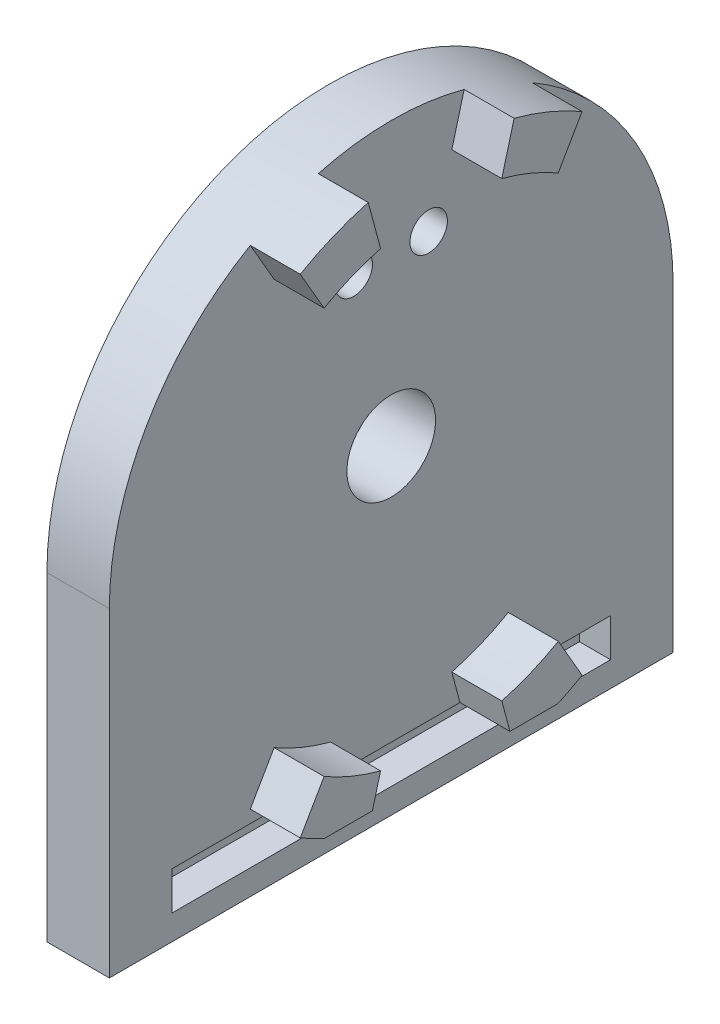
ISO-10303-21;
HEADER;
FILE_DESCRIPTION(('STEP AP214'),'2;1');
FILE_NAME('part.step','',(''),(''),'','','');
FILE_SCHEMA(('AUTOMOTIVE_DESIGN { 1 0 10303 214 1 1 1 1 }'));
ENDSEC;
DATA;
#1=APPLICATION_CONTEXT('core data for automotive mechanical design processes');
#2=APPLICATION_PROTOCOL_DEFINITION('international standard','automotive_design',2000,#1);
#3=PRODUCT_CONTEXT('',#1,'mechanical');
#4=PRODUCT('Part','Part','',(#3));
#5=PRODUCT_RELATED_PRODUCT_CATEGORY('part','',(#4));
#6=PRODUCT_DEFINITION_FORMATION('','',#4);
#7=PRODUCT_DEFINITION_CONTEXT('part definition',#1,'design');
#8=PRODUCT_DEFINITION('design','',#6,#7);
#9=PRODUCT_DEFINITION_SHAPE('','',#8);
#10=(LENGTH_UNIT() NAMED_UNIT(*) SI_UNIT(.MILLI.,.METRE.));
#11=(NAMED_UNIT(*) PLANE_ANGLE_UNIT() SI_UNIT($,.RADIAN.));
#12=(NAMED_UNIT(*) SI_UNIT($,.STERADIAN.) SOLID_ANGLE_UNIT());
#13=UNCERTAINTY_MEASURE_WITH_UNIT(LENGTH_MEASURE(1.E-05),#10,'distance_accuracy_value','');
#14=(GEOMETRIC_REPRESENTATION_CONTEXT(3) GLOBAL_UNCERTAINTY_ASSIGNED_CONTEXT((#13)) GLOBAL_UNIT_ASSIGNED_CONTEXT((#10,
#11,#12)) REPRESENTATION_CONTEXT('',''));
#15=CARTESIAN_POINT('',(0.,0.,0.));
#16=DIRECTION('',(0.,0.,1.));
#17=DIRECTION('',(1.,0.,0.));
#18=AXIS2_PLACEMENT_3D('',#15,#16,#17);
#19=CARTESIAN_POINT('',(5.,0.,0.));
#20=DIRECTION('',(1.,0.,0.));
#21=DIRECTION('',(0.,0.,-1.));
#22=AXIS2_PLACEMENT_3D('',#19,#20,#21);
#23=PLANE('',#22);
#24=CARTESIAN_POINT('',(5.,0.,0.));
#25=DIRECTION('',(1.,0.,0.));
#26=DIRECTION('',(0.,0.,-1.));
#27=AXIS2_PLACEMENT_3D('',#24,#25,#26);
#28=CIRCLE('',#27,3.55);
#29=CARTESIAN_POINT('',(5.,0.,-3.55));
#30=VERTEX_POINT('',#29);
#31=EDGE_CURVE('E394',#30,#30,#28,.T.);
#32=ORIENTED_EDGE('',*,*,#31,.F.);
#33=EDGE_LOOP('',(#32));
#34=FACE_BOUND('',#33,.T.);
#35=CARTESIAN_POINT('',(5.,13.3711548870498,-3.00000000000006));
#36=DIRECTION('',(1.,0.,0.));
#37=DIRECTION('',(0.,0.,-1.));
#38=AXIS2_PLACEMENT_3D('',#35,#36,#37);
#39=CIRCLE('',#38,1.5);
#40=CARTESIAN_POINT('',(5.,13.3711548870498,-4.50000000000006));
#41=VERTEX_POINT('',#40);
#42=EDGE_CURVE('E391',#41,#41,#39,.T.);
#43=ORIENTED_EDGE('',*,*,#42,.F.);
#44=EDGE_LOOP('',(#43));
#45=FACE_BOUND('',#44,.T.);
#46=CARTESIAN_POINT('',(5.,13.3711548870498,2.99999999999995));
#47=DIRECTION('',(1.,0.,0.));
#48=DIRECTION('',(0.,0.,-1.));
#49=AXIS2_PLACEMENT_3D('',#46,#47,#48);
#50=CIRCLE('',#49,1.5);
#51=CARTESIAN_POINT('',(5.,13.3711548870498,1.49999999999994));
#52=VERTEX_POINT('',#51);
#53=EDGE_CURVE('E388',#52,#52,#50,.T.);
#54=ORIENTED_EDGE('',*,*,#53,.F.);
#55=EDGE_LOOP('',(#54));
#56=FACE_BOUND('',#55,.T.);
#57=CARTESIAN_POINT('',(5.,0.,0.));
#58=DIRECTION('',(1.,0.,0.));
#59=DIRECTION('',(0.,0.,-1.));
#60=AXIS2_PLACEMENT_3D('',#57,#58,#59);
#61=CIRCLE('',#60,22.5679605264164);
#62=CARTESIAN_POINT('',(5.,0.,-22.5679605264164));
#63=VERTEX_POINT('',#62);
#64=CARTESIAN_POINT('',(5.,19.544427127481,-11.2839802632083));
#65=VERTEX_POINT('',#64);
#66=EDGE_CURVE('E11',#63,#65,#61,.T.);
#67=ORIENTED_EDGE('',*,*,#66,.T.);
#68=DIRECTION('',(0.,0.866025403784436,-0.500000000000004));
#69=VECTOR('',#68,1.);
#70=CARTESIAN_POINT('',(5.,0.,0.));
#71=LINE('',#70,#69);
#72=CARTESIAN_POINT('',(5.,16.2379763209582,-9.37500000000008));
#73=VERTEX_POINT('',#72);
#74=EDGE_CURVE('E299',#73,#65,#71,.T.);
#75=ORIENTED_EDGE('',*,*,#74,.F.);
#76=CARTESIAN_POINT('',(5.,0.,0.));
#77=DIRECTION('',(1.,0.,0.));
#78=DIRECTION('',(0.,0.,-1.));
#79=AXIS2_PLACEMENT_3D('',#76,#77,#78);
#80=CIRCLE('',#79,18.75);
#81=CARTESIAN_POINT('',(5.,18.11110924292,-4.85285709567234));
#82=VERTEX_POINT('',#81);
#83=EDGE_CURVE('E285',#73,#82,#80,.T.);
#84=ORIENTED_EDGE('',*,*,#83,.T.);
#85=DIRECTION('',(0.,0.965925826289067,-0.258819045102525));
#86=VECTOR('',#85,1.);
#87=CARTESIAN_POINT('',(5.,0.,0.));
#88=LINE('',#87,#86);
#89=CARTESIAN_POINT('',(5.,21.7989759191378,-5.84101799335856));
#90=VERTEX_POINT('',#89);
#91=EDGE_CURVE('E290',#82,#90,#88,.T.);
#92=ORIENTED_EDGE('',*,*,#91,.T.);
#93=CARTESIAN_POINT('',(5.,21.7989759191378,5.84101799335841));
#94=VERTEX_POINT('',#93);
#95=EDGE_CURVE('E43',#90,#94,#61,.T.);
#96=ORIENTED_EDGE('',*,*,#95,.T.);
#97=DIRECTION('',(0.,0.965925826289069,0.258819045102518));
#98=VECTOR('',#97,1.);
#99=CARTESIAN_POINT('',(5.,0.,0.));
#100=LINE('',#99,#98);
#101=CARTESIAN_POINT('',(5.,18.1111092429201,4.85285709567222));
#102=VERTEX_POINT('',#101);
#103=EDGE_CURVE('E329',#102,#94,#100,.T.);
#104=ORIENTED_EDGE('',*,*,#103,.F.);
#105=CARTESIAN_POINT('',(5.,0.,0.));
#106=DIRECTION('',(1.,0.,0.));
#107=DIRECTION('',(0.,0.,-1.));
#108=AXIS2_PLACEMENT_3D('',#105,#106,#107);
#109=CIRCLE('',#108,18.75);
#110=CARTESIAN_POINT('',(5.,16.2379763209582,9.37499999999997));
#111=VERTEX_POINT('',#110);
#112=EDGE_CURVE('E315',#102,#111,#109,.T.);
#113=ORIENTED_EDGE('',*,*,#112,.T.);
#114=DIRECTION('',(0.,0.86602540378444,0.499999999999998));
#115=VECTOR('',#114,1.);
#116=CARTESIAN_POINT('',(5.,0.,0.));
#117=LINE('',#116,#115);
#118=CARTESIAN_POINT('',(5.,19.544427127481,11.2839802632081));
#119=VERTEX_POINT('',#118);
#120=EDGE_CURVE('E320',#111,#119,#117,.T.);
#121=ORIENTED_EDGE('',*,*,#120,.T.);
#122=CARTESIAN_POINT('',(5.,0.,22.5679605264164));
#123=VERTEX_POINT('',#122);
#124=EDGE_CURVE('E44',#119,#123,#61,.T.);
#125=ORIENTED_EDGE('',*,*,#124,.T.);
#126=DIRECTION('',(0.,-1.,0.));
#127=VECTOR('',#126,1.);
#128=CARTESIAN_POINT('',(5.,0.,22.5679605264164));
#129=LINE('',#128,#127);
#130=CARTESIAN_POINT('',(5.,-25.6160132593581,22.5679605264164));
#131=VERTEX_POINT('',#130);
#132=EDGE_CURVE('E397',#123,#131,#129,.T.);
#133=ORIENTED_EDGE('',*,*,#132,.T.);
#134=DIRECTION('',(0.,0.,-1.));
#135=VECTOR('',#134,1.);
#136=CARTESIAN_POINT('',(5.,-25.6160132593581,22.5679605264164));
#137=LINE('',#136,#135);
#138=CARTESIAN_POINT('',(5.,-25.6160132593581,-22.5679605264164));
#139=VERTEX_POINT('',#138);
#140=EDGE_CURVE('E410',#131,#139,#137,.T.);
#141=ORIENTED_EDGE('',*,*,#140,.T.);
#142=DIRECTION('',(0.,1.,0.));
#143=VECTOR('',#142,1.);
#144=CARTESIAN_POINT('',(5.,-25.6160132593581,-22.5679605264164));
#145=LINE('',#144,#143);
#146=EDGE_CURVE('E402',#139,#63,#145,.T.);
#147=ORIENTED_EDGE('',*,*,#146,.T.);
#148=EDGE_LOOP('',(#67,#75,#84,#92,#96,#104,#113,#121,#125,#133,#141,#147));
#149=FACE_BOUND('',#148,.T.);
#150=DIRECTION('',(0.,0.,1.));
#151=VECTOR('',#150,1.);
#152=CARTESIAN_POINT('',(5.,-20.55,17.5679605264164));
#153=LINE('',#152,#151);
#154=CARTESIAN_POINT('',(5.,-20.55,-5.50635590445966));
#155=VERTEX_POINT('',#154);
#156=CARTESIAN_POINT('',(5.,-20.55,5.50635590445952));
#157=VERTEX_POINT('',#156);
#158=EDGE_CURVE('E369',#155,#157,#153,.T.);
#159=ORIENTED_EDGE('',*,*,#158,.F.);
#160=DIRECTION('',(0.,-0.965925826289067,-0.258819045102525));
#161=VECTOR('',#160,1.);
#162=CARTESIAN_POINT('',(5.,0.,0.));
#163=LINE('',#162,#161);
#164=CARTESIAN_POINT('',(5.,-18.11110924292,-4.85285709567234));
#165=VERTEX_POINT('',#164);
#166=EDGE_CURVE('E235',#165,#155,#163,.T.);
#167=ORIENTED_EDGE('',*,*,#166,.F.);
#168=CARTESIAN_POINT('',(5.,0.,0.));
#169=DIRECTION('',(1.,0.,0.));
#170=DIRECTION('',(0.,0.,-1.));
#171=AXIS2_PLACEMENT_3D('',#168,#169,#170);
#172=CIRCLE('',#171,18.75);
#173=CARTESIAN_POINT('',(5.,-16.2379763209582,-9.37500000000008));
#174=VERTEX_POINT('',#173);
#175=EDGE_CURVE('E244',#174,#165,#172,.F.);
#176=ORIENTED_EDGE('',*,*,#175,.F.);
#177=DIRECTION('',(0.,-0.866025403784436,-0.500000000000004));
#178=VECTOR('',#177,1.);
#179=CARTESIAN_POINT('',(5.,0.,0.));
#180=LINE('',#179,#178);
#181=CARTESIAN_POINT('',(5.,-19.544427127481,-11.2839802632083));
#182=VERTEX_POINT('',#181);
#183=EDGE_CURVE('E216',#174,#182,#180,.T.);
#184=ORIENTED_EDGE('',*,*,#183,.T.);
#185=CARTESIAN_POINT('',(5.,0.,0.));
#186=DIRECTION('',(1.,0.,0.));
#187=DIRECTION('',(0.,0.,-1.));
#188=AXIS2_PLACEMENT_3D('',#185,#186,#187);
#189=CIRCLE('',#188,22.5679605264164);
#190=CARTESIAN_POINT('',(5.,-20.55,-9.32793344325995));
#191=VERTEX_POINT('',#190);
#192=EDGE_CURVE('E232',#182,#191,#189,.F.);
#193=ORIENTED_EDGE('',*,*,#192,.T.);
#194=CARTESIAN_POINT('',(5.,-20.55,-17.5679605264164));
#195=VERTEX_POINT('',#194);
#196=EDGE_CURVE('E349',#195,#191,#153,.T.);
#197=ORIENTED_EDGE('',*,*,#196,.F.);
#198=DIRECTION('',(0.,1.,0.));
#199=VECTOR('',#198,1.);
#200=CARTESIAN_POINT('',(5.,-20.55,-17.5679605264164));
#201=LINE('',#200,#199);
#202=CARTESIAN_POINT('',(5.,-23.6160132593581,-17.5679605264164));
#203=VERTEX_POINT('',#202);
#204=EDGE_CURVE('E363',#203,#195,#201,.T.);
#205=ORIENTED_EDGE('',*,*,#204,.F.);
#206=DIRECTION('',(0.,0.,-1.));
#207=VECTOR('',#206,1.);
#208=CARTESIAN_POINT('',(5.,-23.6160132593581,17.5679605264164));
#209=LINE('',#208,#207);
#210=CARTESIAN_POINT('',(5.,-23.6160132593581,17.5679605264164));
#211=VERTEX_POINT('',#210);
#212=EDGE_CURVE('E360',#211,#203,#209,.T.);
#213=ORIENTED_EDGE('',*,*,#212,.F.);
#214=DIRECTION('',(0.,-1.,0.));
#215=VECTOR('',#214,1.);
#216=CARTESIAN_POINT('',(5.,-20.55,17.5679605264164));
#217=LINE('',#216,#215);
#218=CARTESIAN_POINT('',(5.,-20.55,17.5679605264164));
#219=VERTEX_POINT('',#218);
#220=EDGE_CURVE('E344',#219,#211,#217,.T.);
#221=ORIENTED_EDGE('',*,*,#220,.F.);
#222=CARTESIAN_POINT('',(5.,-20.55,9.32793344325995));
#223=VERTEX_POINT('',#222);
#224=EDGE_CURVE('E366',#223,#219,#153,.T.);
#225=ORIENTED_EDGE('',*,*,#224,.F.);
#226=CARTESIAN_POINT('',(5.,0.,0.));
#227=DIRECTION('',(1.,0.,0.));
#228=DIRECTION('',(0.,0.,-1.));
#229=AXIS2_PLACEMENT_3D('',#226,#227,#228);
#230=CIRCLE('',#229,22.5679605264164);
#231=CARTESIAN_POINT('',(5.,-19.544427127481,11.2839802632081));
#232=VERTEX_POINT('',#231);
#233=EDGE_CURVE('E59',#223,#232,#230,.F.);
#234=ORIENTED_EDGE('',*,*,#233,.T.);
#235=DIRECTION('',(0.,-0.86602540378444,0.499999999999998));
#236=VECTOR('',#235,1.);
#237=CARTESIAN_POINT('',(5.,0.,0.));
#238=LINE('',#237,#236);
#239=CARTESIAN_POINT('',(5.,-16.2379763209582,9.37499999999996));
#240=VERTEX_POINT('',#239);
#241=EDGE_CURVE('E256',#240,#232,#238,.T.);
#242=ORIENTED_EDGE('',*,*,#241,.F.);
#243=CARTESIAN_POINT('',(5.,0.,0.));
#244=DIRECTION('',(1.,0.,0.));
#245=DIRECTION('',(0.,0.,-1.));
#246=AXIS2_PLACEMENT_3D('',#243,#244,#245);
#247=CIRCLE('',#246,18.75);
#248=CARTESIAN_POINT('',(5.,-18.11110924292,4.85285709567222));
#249=VERTEX_POINT('',#248);
#250=EDGE_CURVE('E270',#249,#240,#247,.F.);
#251=ORIENTED_EDGE('',*,*,#250,.F.);
#252=DIRECTION('',(0.,-0.965925826289069,0.258819045102518));
#253=VECTOR('',#252,1.);
#254=CARTESIAN_POINT('',(5.,0.,0.));
#255=LINE('',#254,#253);
#256=EDGE_CURVE('E267',#249,#157,#255,.T.);
#257=ORIENTED_EDGE('',*,*,#256,.T.);
#258=EDGE_LOOP('',(#159,#167,#176,#184,#193,#197,#205,#213,#221,#225,#234,#242,#251,#257));
#259=FACE_BOUND('',#258,.T.);
#260=ADVANCED_FACE('F34',(#34,#45,#56,#149,#259),#23,.T.);
#261=CARTESIAN_POINT('',(5.,0.,0.));
#262=DIRECTION('',(-1.,0.,0.));
#263=DIRECTION('',(0.,0.,1.));
#264=AXIS2_PLACEMENT_3D('',#261,#262,#263);
#265=CYLINDRICAL_SURFACE('',#264,22.5679605264164);
#266=ORIENTED_EDGE('',*,*,#66,.F.);
#267=DIRECTION('',(1.,0.,0.));
#268=VECTOR('',#267,1.);
#269=CARTESIAN_POINT('',(0.,0.,-22.5679605264164));
#270=LINE('',#269,#268);
#271=CARTESIAN_POINT('',(0.,0.,-22.5679605264164));
#272=VERTEX_POINT('',#271);
#273=EDGE_CURVE('E414',#272,#63,#270,.T.);
#274=ORIENTED_EDGE('',*,*,#273,.F.);
#275=CARTESIAN_POINT('',(0.,0.,0.));
#276=DIRECTION('',(1.,0.,0.));
#277=DIRECTION('',(0.,0.,-1.));
#278=AXIS2_PLACEMENT_3D('',#275,#276,#277);
#279=CIRCLE('',#278,22.5679605264164);
#280=CARTESIAN_POINT('',(0.,0.,22.5679605264164));
#281=VERTEX_POINT('',#280);
#282=EDGE_CURVE('E38',#272,#281,#279,.T.);
#283=ORIENTED_EDGE('',*,*,#282,.T.);
#284=DIRECTION('',(1.,0.,0.));
#285=VECTOR('',#284,1.);
#286=CARTESIAN_POINT('',(0.,0.,22.5679605264164));
#287=LINE('',#286,#285);
#288=EDGE_CURVE('E407',#281,#123,#287,.T.);
#289=ORIENTED_EDGE('',*,*,#288,.T.);
#290=ORIENTED_EDGE('',*,*,#124,.F.);
#291=DIRECTION('',(-1.,0.,0.));
#292=VECTOR('',#291,1.);
#293=CARTESIAN_POINT('',(9.,19.544427127481,11.2839802632081));
#294=LINE('',#293,#292);
#295=CARTESIAN_POINT('',(9.,19.544427127481,11.2839802632081));
#296=VERTEX_POINT('',#295);
#297=EDGE_CURVE('E335',#296,#119,#294,.T.);
#298=ORIENTED_EDGE('',*,*,#297,.F.);
#299=CARTESIAN_POINT('',(9.,0.,0.));
#300=DIRECTION('',(1.,0.,0.));
#301=DIRECTION('',(0.,0.,-1.));
#302=AXIS2_PLACEMENT_3D('',#299,#300,#301);
#303=CIRCLE('',#302,22.5679605264164);
#304=CARTESIAN_POINT('',(9.,21.7989759191378,5.84101799335841));
#305=VERTEX_POINT('',#304);
#306=EDGE_CURVE('E322',#305,#296,#303,.T.);
#307=ORIENTED_EDGE('',*,*,#306,.F.);
#308=DIRECTION('',(-1.,0.,0.));
#309=VECTOR('',#308,1.);
#310=CARTESIAN_POINT('',(9.,21.7989759191378,5.84101799335841));
#311=LINE('',#310,#309);
#312=EDGE_CURVE('E338',#305,#94,#311,.T.);
#313=ORIENTED_EDGE('',*,*,#312,.T.);
#314=ORIENTED_EDGE('',*,*,#95,.F.);
#315=DIRECTION('',(-1.,0.,0.));
#316=VECTOR('',#315,1.);
#317=CARTESIAN_POINT('',(9.,21.7989759191378,-5.84101799335856));
#318=LINE('',#317,#316);
#319=CARTESIAN_POINT('',(9.,21.7989759191378,-5.84101799335856));
#320=VERTEX_POINT('',#319);
#321=EDGE_CURVE('E306',#320,#90,#318,.T.);
#322=ORIENTED_EDGE('',*,*,#321,.F.);
#323=CARTESIAN_POINT('',(9.,0.,0.));
#324=DIRECTION('',(1.,0.,0.));
#325=DIRECTION('',(0.,0.,-1.));
#326=AXIS2_PLACEMENT_3D('',#323,#324,#325);
#327=CIRCLE('',#326,22.5679605264164);
#328=CARTESIAN_POINT('',(9.,19.544427127481,-11.2839802632083));
#329=VERTEX_POINT('',#328);
#330=EDGE_CURVE('E292',#329,#320,#327,.T.);
#331=ORIENTED_EDGE('',*,*,#330,.F.);
#332=DIRECTION('',(-1.,0.,0.));
#333=VECTOR('',#332,1.);
#334=CARTESIAN_POINT('',(9.,19.544427127481,-11.2839802632083));
#335=LINE('',#334,#333);
#336=EDGE_CURVE('E309',#329,#65,#335,.T.);
#337=ORIENTED_EDGE('',*,*,#336,.T.);
#338=EDGE_LOOP('',(#266,#274,#283,#289,#290,#298,#307,#313,#314,#322,#331,#337));
#339=FACE_BOUND('',#338,.T.);
#340=ADVANCED_FACE('F36',(#339),#265,.T.);
#341=CARTESIAN_POINT('',(0.,0.,0.));
#342=DIRECTION('',(1.,0.,0.));
#343=DIRECTION('',(0.,0.,-1.));
#344=AXIS2_PLACEMENT_3D('',#341,#342,#343);
#345=PLANE('',#344);
#346=CARTESIAN_POINT('',(0.,0.,0.));
#347=DIRECTION('',(1.,0.,0.));
#348=DIRECTION('',(0.,0.,-1.));
#349=AXIS2_PLACEMENT_3D('',#346,#347,#348);
#350=CIRCLE('',#349,3.55);
#351=CARTESIAN_POINT('',(0.,0.,-3.55));
#352=VERTEX_POINT('',#351);
#353=EDGE_CURVE('E373',#352,#352,#350,.T.);
#354=ORIENTED_EDGE('',*,*,#353,.T.);
#355=EDGE_LOOP('',(#354));
#356=FACE_BOUND('',#355,.T.);
#357=CARTESIAN_POINT('',(0.,13.3711548870498,-3.00000000000006));
#358=DIRECTION('',(1.,0.,0.));
#359=DIRECTION('',(0.,0.,-1.));
#360=AXIS2_PLACEMENT_3D('',#357,#358,#359);
#361=CIRCLE('',#360,1.5);
#362=CARTESIAN_POINT('',(0.,13.3711548870498,-4.50000000000006));
#363=VERTEX_POINT('',#362);
#364=EDGE_CURVE('E380',#363,#363,#361,.T.);
#365=ORIENTED_EDGE('',*,*,#364,.T.);
#366=EDGE_LOOP('',(#365));
#367=FACE_BOUND('',#366,.T.);
#368=CARTESIAN_POINT('',(0.,13.3711548870498,2.99999999999995));
#369=DIRECTION('',(1.,0.,0.));
#370=DIRECTION('',(0.,0.,-1.));
#371=AXIS2_PLACEMENT_3D('',#368,#369,#370);
#372=CIRCLE('',#371,1.5);
#373=CARTESIAN_POINT('',(0.,13.3711548870498,1.49999999999994));
#374=VERTEX_POINT('',#373);
#375=EDGE_CURVE('E383',#374,#374,#372,.T.);
#376=ORIENTED_EDGE('',*,*,#375,.T.);
#377=EDGE_LOOP('',(#376));
#378=FACE_BOUND('',#377,.T.);
#379=ORIENTED_EDGE('',*,*,#282,.F.);
#380=DIRECTION('',(0.,1.,0.));
#381=VECTOR('',#380,1.);
#382=CARTESIAN_POINT('',(0.,-25.6160132593581,-22.5679605264164));
#383=LINE('',#382,#381);
#384=CARTESIAN_POINT('',(0.,-25.6160132593581,-22.5679605264164));
#385=VERTEX_POINT('',#384);
#386=EDGE_CURVE('E405',#385,#272,#383,.T.);
#387=ORIENTED_EDGE('',*,*,#386,.F.);
#388=DIRECTION('',(0.,0.,-1.));
#389=VECTOR('',#388,1.);
#390=CARTESIAN_POINT('',(0.,-25.6160132593581,22.5679605264164));
#391=LINE('',#390,#389);
#392=CARTESIAN_POINT('',(0.,-25.6160132593581,22.5679605264164));
#393=VERTEX_POINT('',#392);
#394=EDGE_CURVE('E401',#393,#385,#391,.T.);
#395=ORIENTED_EDGE('',*,*,#394,.F.);
#396=DIRECTION('',(0.,-1.,0.));
#397=VECTOR('',#396,1.);
#398=CARTESIAN_POINT('',(0.,0.,22.5679605264164));
#399=LINE('',#398,#397);
#400=EDGE_CURVE('E398',#281,#393,#399,.T.);
#401=ORIENTED_EDGE('',*,*,#400,.F.);
#402=EDGE_LOOP('',(#379,#387,#395,#401));
#403=FACE_BOUND('',#402,.T.);
#404=ADVANCED_FACE('F435',(#356,#367,#378,#403),#345,.F.);
#405=CARTESIAN_POINT('',(0.,-25.6160132593581,-22.5679605264164));
#406=DIRECTION('',(0.,0.,-1.));
#407=DIRECTION('',(-1.,0.,0.));
#408=AXIS2_PLACEMENT_3D('',#405,#406,#407);
#409=PLANE('',#408);
#410=ORIENTED_EDGE('',*,*,#146,.F.);
#411=DIRECTION('',(1.,0.,0.));
#412=VECTOR('',#411,1.);
#413=CARTESIAN_POINT('',(0.,-25.6160132593581,-22.5679605264164));
#414=LINE('',#413,#412);
#415=EDGE_CURVE('E417',#385,#139,#414,.T.);
#416=ORIENTED_EDGE('',*,*,#415,.F.);
#417=ORIENTED_EDGE('',*,*,#386,.T.);
#418=ORIENTED_EDGE('',*,*,#273,.T.);
#419=EDGE_LOOP('',(#410,#416,#417,#418));
#420=FACE_BOUND('',#419,.T.);
#421=ADVANCED_FACE('F480',(#420),#409,.T.);
#422=CARTESIAN_POINT('',(0.,-25.6160132593581,22.5679605264164));
#423=DIRECTION('',(0.,-1.,0.));
#424=DIRECTION('',(0.,0.,-1.));
#425=AXIS2_PLACEMENT_3D('',#422,#423,#424);
#426=PLANE('',#425);
#427=ORIENTED_EDGE('',*,*,#140,.F.);
#428=DIRECTION('',(1.,0.,0.));
#429=VECTOR('',#428,1.);
#430=CARTESIAN_POINT('',(0.,-25.6160132593581,22.5679605264164));
#431=LINE('',#430,#429);
#432=EDGE_CURVE('E419',#393,#131,#431,.T.);
#433=ORIENTED_EDGE('',*,*,#432,.F.);
#434=ORIENTED_EDGE('',*,*,#394,.T.);
#435=ORIENTED_EDGE('',*,*,#415,.T.);
#436=EDGE_LOOP('',(#427,#433,#434,#435));
#437=FACE_BOUND('',#436,.T.);
#438=ADVANCED_FACE('F439',(#437),#426,.T.);
#439=CARTESIAN_POINT('',(0.,0.,22.5679605264164));
#440=DIRECTION('',(0.,0.,1.));
#441=DIRECTION('',(0.,-1.,0.));
#442=AXIS2_PLACEMENT_3D('',#439,#440,#441);
#443=PLANE('',#442);
#444=ORIENTED_EDGE('',*,*,#132,.F.);
#445=ORIENTED_EDGE('',*,*,#288,.F.);
#446=ORIENTED_EDGE('',*,*,#400,.T.);
#447=ORIENTED_EDGE('',*,*,#432,.T.);
#448=EDGE_LOOP('',(#444,#445,#446,#447));
#449=FACE_BOUND('',#448,.T.);
#450=ADVANCED_FACE('F432',(#449),#443,.T.);
#451=CARTESIAN_POINT('',(0.,13.3711548870498,2.99999999999995));
#452=DIRECTION('',(1.,0.,0.));
#453=DIRECTION('',(0.,0.,-1.));
#454=AXIS2_PLACEMENT_3D('',#451,#452,#453);
#455=CYLINDRICAL_SURFACE('',#454,1.5);
#456=ORIENTED_EDGE('',*,*,#53,.T.);
#457=EDGE_LOOP('',(#456));
#458=FACE_BOUND('',#457,.T.);
#459=ORIENTED_EDGE('',*,*,#375,.F.);
#460=EDGE_LOOP('',(#459));
#461=FACE_BOUND('',#460,.T.);
#462=ADVANCED_FACE('F493',(#458,#461),#455,.F.);
#463=CARTESIAN_POINT('',(0.,13.3711548870498,-3.00000000000006));
#464=DIRECTION('',(1.,0.,0.));
#465=DIRECTION('',(0.,0.,-1.));
#466=AXIS2_PLACEMENT_3D('',#463,#464,#465);
#467=CYLINDRICAL_SURFACE('',#466,1.5);
#468=ORIENTED_EDGE('',*,*,#42,.T.);
#469=EDGE_LOOP('',(#468));
#470=FACE_BOUND('',#469,.T.);
#471=ORIENTED_EDGE('',*,*,#364,.F.);
#472=EDGE_LOOP('',(#471));
#473=FACE_BOUND('',#472,.T.);
#474=ADVANCED_FACE('F495',(#470,#473),#467,.F.);
#475=CARTESIAN_POINT('',(0.,0.,0.));
#476=DIRECTION('',(1.,0.,0.));
#477=DIRECTION('',(0.,0.,-1.));
#478=AXIS2_PLACEMENT_3D('',#475,#476,#477);
#479=CYLINDRICAL_SURFACE('',#478,3.55);
#480=ORIENTED_EDGE('',*,*,#31,.T.);
#481=EDGE_LOOP('',(#480));
#482=FACE_BOUND('',#481,.T.);
#483=ORIENTED_EDGE('',*,*,#353,.F.);
#484=EDGE_LOOP('',(#483));
#485=FACE_BOUND('',#484,.T.);
#486=ADVANCED_FACE('F502',(#482,#485),#479,.F.);
#487=CARTESIAN_POINT('',(2.5,-20.55,17.5679605264164));
#488=DIRECTION('',(0.,0.,1.));
#489=DIRECTION('',(1.,0.,0.));
#490=AXIS2_PLACEMENT_3D('',#487,#488,#489);
#491=PLANE('',#490);
#492=ORIENTED_EDGE('',*,*,#220,.T.);
#493=DIRECTION('',(1.,0.,0.));
#494=VECTOR('',#493,1.);
#495=CARTESIAN_POINT('',(2.5,-23.6160132593581,17.5679605264164));
#496=LINE('',#495,#494);
#497=CARTESIAN_POINT('',(2.5,-23.6160132593581,17.5679605264164));
#498=VERTEX_POINT('',#497);
#499=EDGE_CURVE('E358',#498,#211,#496,.T.);
#500=ORIENTED_EDGE('',*,*,#499,.F.);
#501=DIRECTION('',(0.,-1.,0.));
#502=VECTOR('',#501,1.);
#503=CARTESIAN_POINT('',(2.5,-20.55,17.5679605264164));
#504=LINE('',#503,#502);
#505=CARTESIAN_POINT('',(2.5,-20.55,17.5679605264164));
#506=VERTEX_POINT('',#505);
#507=EDGE_CURVE('E345',#506,#498,#504,.T.);
#508=ORIENTED_EDGE('',*,*,#507,.F.);
#509=DIRECTION('',(1.,0.,0.));
#510=VECTOR('',#509,1.);
#511=CARTESIAN_POINT('',(2.5,-20.55,17.5679605264164));
#512=LINE('',#511,#510);
#513=EDGE_CURVE('E370',#506,#219,#512,.T.);
#514=ORIENTED_EDGE('',*,*,#513,.T.);
#515=EDGE_LOOP('',(#492,#500,#508,#514));
#516=FACE_BOUND('',#515,.T.);
#517=ADVANCED_FACE('F540',(#516),#491,.F.);
#518=CARTESIAN_POINT('',(2.5,-20.55,17.5679605264164));
#519=DIRECTION('',(0.,1.,0.));
#520=DIRECTION('',(0.,0.,1.));
#521=AXIS2_PLACEMENT_3D('',#518,#519,#520);
#522=PLANE('',#521);
#523=ORIENTED_EDGE('',*,*,#196,.T.);
#524=DIRECTION('',(-1.,0.,0.));
#525=VECTOR('',#524,1.);
#526=CARTESIAN_POINT('',(9.,-20.55,-9.32793344325995));
#527=LINE('',#526,#525);
#528=CARTESIAN_POINT('',(9.,-20.55,-9.32793344325995));
#529=VERTEX_POINT('',#528);
#530=EDGE_CURVE('E248',#529,#191,#527,.T.);
#531=ORIENTED_EDGE('',*,*,#530,.F.);
#532=DIRECTION('',(0.,0.,-1.));
#533=VECTOR('',#532,1.);
#534=CARTESIAN_POINT('',(9.,-20.55,0.));
#535=LINE('',#534,#533);
#536=CARTESIAN_POINT('',(9.,-20.55,-5.50635590445966));
#537=VERTEX_POINT('',#536);
#538=EDGE_CURVE('E239',#537,#529,#535,.T.);
#539=ORIENTED_EDGE('',*,*,#538,.F.);
#540=DIRECTION('',(-1.,0.,0.));
#541=VECTOR('',#540,1.);
#542=CARTESIAN_POINT('',(9.,-20.55,-5.50635590445966));
#543=LINE('',#542,#541);
#544=EDGE_CURVE('E51',#537,#155,#543,.T.);
#545=ORIENTED_EDGE('',*,*,#544,.T.);
#546=ORIENTED_EDGE('',*,*,#158,.T.);
#547=DIRECTION('',(-1.,0.,0.));
#548=VECTOR('',#547,1.);
#549=CARTESIAN_POINT('',(9.,-20.55,5.50635590445952));
#550=LINE('',#549,#548);
#551=CARTESIAN_POINT('',(9.,-20.55,5.50635590445952));
#552=VERTEX_POINT('',#551);
#553=EDGE_CURVE('E280',#552,#157,#550,.T.);
#554=ORIENTED_EDGE('',*,*,#553,.F.);
#555=DIRECTION('',(0.,0.,-1.));
#556=VECTOR('',#555,1.);
#557=CARTESIAN_POINT('',(9.,-20.55,0.));
#558=LINE('',#557,#556);
#559=CARTESIAN_POINT('',(9.,-20.55,9.32793344325995));
#560=VERTEX_POINT('',#559);
#561=EDGE_CURVE('E255',#560,#552,#558,.T.);
#562=ORIENTED_EDGE('',*,*,#561,.F.);
#563=DIRECTION('',(-1.,0.,0.));
#564=VECTOR('',#563,1.);
#565=CARTESIAN_POINT('',(9.,-20.55,9.32793344325995));
#566=LINE('',#565,#564);
#567=EDGE_CURVE('E283',#560,#223,#566,.T.);
#568=ORIENTED_EDGE('',*,*,#567,.T.);
#569=ORIENTED_EDGE('',*,*,#224,.T.);
#570=ORIENTED_EDGE('',*,*,#513,.F.);
#571=DIRECTION('',(0.,0.,1.));
#572=VECTOR('',#571,1.);
#573=CARTESIAN_POINT('',(2.5,-20.55,17.5679605264164));
#574=LINE('',#573,#572);
#575=CARTESIAN_POINT('',(2.5,-20.55,-17.5679605264164));
#576=VERTEX_POINT('',#575);
#577=EDGE_CURVE('E355',#576,#506,#574,.T.);
#578=ORIENTED_EDGE('',*,*,#577,.F.);
#579=DIRECTION('',(1.,0.,0.));
#580=VECTOR('',#579,1.);
#581=CARTESIAN_POINT('',(2.5,-20.55,-17.5679605264164));
#582=LINE('',#581,#580);
#583=EDGE_CURVE('E374',#576,#195,#582,.T.);
#584=ORIENTED_EDGE('',*,*,#583,.T.);
#585=EDGE_LOOP('',(#523,#531,#539,#545,#546,#554,#562,#568,#569,#570,#578,#584));
#586=FACE_BOUND('',#585,.T.);
#587=ADVANCED_FACE('F549',(#586),#522,.F.);
#588=CARTESIAN_POINT('',(2.5,-20.55,-17.5679605264164));
#589=DIRECTION('',(0.,0.,-1.));
#590=DIRECTION('',(0.,1.,0.));
#591=AXIS2_PLACEMENT_3D('',#588,#589,#590);
#592=PLANE('',#591);
#593=ORIENTED_EDGE('',*,*,#204,.T.);
#594=ORIENTED_EDGE('',*,*,#583,.F.);
#595=DIRECTION('',(0.,1.,0.));
#596=VECTOR('',#595,1.);
#597=CARTESIAN_POINT('',(2.5,-20.55,-17.5679605264164));
#598=LINE('',#597,#596);
#599=CARTESIAN_POINT('',(2.5,-23.6160132593581,-17.5679605264164));
#600=VERTEX_POINT('',#599);
#601=EDGE_CURVE('E352',#600,#576,#598,.T.);
#602=ORIENTED_EDGE('',*,*,#601,.F.);
#603=DIRECTION('',(1.,0.,0.));
#604=VECTOR('',#603,1.);
#605=CARTESIAN_POINT('',(2.5,-23.6160132593581,-17.5679605264164));
#606=LINE('',#605,#604);
#607=EDGE_CURVE('E376',#600,#203,#606,.T.);
#608=ORIENTED_EDGE('',*,*,#607,.T.);
#609=EDGE_LOOP('',(#593,#594,#602,#608));
#610=FACE_BOUND('',#609,.T.);
#611=ADVANCED_FACE('F557',(#610),#592,.F.);
#612=CARTESIAN_POINT('',(2.5,-23.6160132593581,17.5679605264164));
#613=DIRECTION('',(0.,-1.,0.));
#614=DIRECTION('',(0.,0.,-1.));
#615=AXIS2_PLACEMENT_3D('',#612,#613,#614);
#616=PLANE('',#615);
#617=ORIENTED_EDGE('',*,*,#212,.T.);
#618=ORIENTED_EDGE('',*,*,#607,.F.);
#619=DIRECTION('',(0.,0.,-1.));
#620=VECTOR('',#619,1.);
#621=CARTESIAN_POINT('',(2.5,-23.6160132593581,17.5679605264164));
#622=LINE('',#621,#620);
#623=EDGE_CURVE('E348',#498,#600,#622,.T.);
#624=ORIENTED_EDGE('',*,*,#623,.F.);
#625=ORIENTED_EDGE('',*,*,#499,.T.);
#626=EDGE_LOOP('',(#617,#618,#624,#625));
#627=FACE_BOUND('',#626,.T.);
#628=ADVANCED_FACE('F562',(#627),#616,.F.);
#629=CARTESIAN_POINT('',(2.5,0.,0.));
#630=DIRECTION('',(1.,0.,0.));
#631=DIRECTION('',(0.,0.,-1.));
#632=AXIS2_PLACEMENT_3D('',#629,#630,#631);
#633=PLANE('',#632);
#634=ORIENTED_EDGE('',*,*,#507,.T.);
#635=ORIENTED_EDGE('',*,*,#623,.T.);
#636=ORIENTED_EDGE('',*,*,#601,.T.);
#637=ORIENTED_EDGE('',*,*,#577,.T.);
#638=EDGE_LOOP('',(#634,#635,#636,#637));
#639=FACE_BOUND('',#638,.T.);
#640=ADVANCED_FACE('F572',(#639),#633,.T.);
#641=CARTESIAN_POINT('',(9.,0.,0.));
#642=DIRECTION('',(-1.,0.,0.));
#643=DIRECTION('',(0.,0.,1.));
#644=AXIS2_PLACEMENT_3D('',#641,#642,#643);
#645=CYLINDRICAL_SURFACE('',#644,18.75);
#646=ORIENTED_EDGE('',*,*,#112,.F.);
#647=DIRECTION('',(-1.,0.,0.));
#648=VECTOR('',#647,1.);
#649=CARTESIAN_POINT('',(9.,18.1111092429201,4.85285709567222));
#650=LINE('',#649,#648);
#651=CARTESIAN_POINT('',(9.,18.1111092429201,4.85285709567222));
#652=VERTEX_POINT('',#651);
#653=EDGE_CURVE('E341',#652,#102,#650,.T.);
#654=ORIENTED_EDGE('',*,*,#653,.F.);
#655=CARTESIAN_POINT('',(9.,0.,0.));
#656=DIRECTION('',(1.,0.,0.));
#657=DIRECTION('',(0.,0.,-1.));
#658=AXIS2_PLACEMENT_3D('',#655,#656,#657);
#659=CIRCLE('',#658,18.75);
#660=CARTESIAN_POINT('',(9.,16.2379763209582,9.37499999999997));
#661=VERTEX_POINT('',#660);
#662=EDGE_CURVE('E316',#652,#661,#659,.T.);
#663=ORIENTED_EDGE('',*,*,#662,.T.);
#664=DIRECTION('',(-1.,0.,0.));
#665=VECTOR('',#664,1.);
#666=CARTESIAN_POINT('',(9.,16.2379763209582,9.37499999999997));
#667=LINE('',#666,#665);
#668=EDGE_CURVE('E327',#661,#111,#667,.T.);
#669=ORIENTED_EDGE('',*,*,#668,.T.);
#670=EDGE_LOOP('',(#646,#654,#663,#669));
#671=FACE_BOUND('',#670,.T.);
#672=ADVANCED_FACE('F457',(#671),#645,.F.);
#673=CARTESIAN_POINT('',(9.,0.,0.));
#674=DIRECTION('',(0.,-0.258819045102518,0.965925826289069));
#675=DIRECTION('',(0.,-0.965925826289069,-0.258819045102518));
#676=AXIS2_PLACEMENT_3D('',#673,#674,#675);
#677=PLANE('',#676);
#678=ORIENTED_EDGE('',*,*,#103,.T.);
#679=ORIENTED_EDGE('',*,*,#312,.F.);
#680=DIRECTION('',(0.,0.965925826289069,0.258819045102518));
#681=VECTOR('',#680,1.);
#682=CARTESIAN_POINT('',(9.,0.,0.));
#683=LINE('',#682,#681);
#684=EDGE_CURVE('E319',#652,#305,#683,.T.);
#685=ORIENTED_EDGE('',*,*,#684,.F.);
#686=ORIENTED_EDGE('',*,*,#653,.T.);
#687=EDGE_LOOP('',(#678,#679,#685,#686));
#688=FACE_BOUND('',#687,.T.);
#689=ADVANCED_FACE('F448',(#688),#677,.F.);
#690=CARTESIAN_POINT('',(9.,0.,0.));
#691=DIRECTION('',(0.,-0.499999999999998,0.86602540378444));
#692=DIRECTION('',(0.,-0.86602540378444,-0.499999999999998));
#693=AXIS2_PLACEMENT_3D('',#690,#691,#692);
#694=PLANE('',#693);
#695=ORIENTED_EDGE('',*,*,#120,.F.);
#696=ORIENTED_EDGE('',*,*,#668,.F.);
#697=DIRECTION('',(0.,0.86602540378444,0.499999999999998));
#698=VECTOR('',#697,1.);
#699=CARTESIAN_POINT('',(9.,0.,0.));
#700=LINE('',#699,#698);
#701=EDGE_CURVE('E324',#661,#296,#700,.T.);
#702=ORIENTED_EDGE('',*,*,#701,.T.);
#703=ORIENTED_EDGE('',*,*,#297,.T.);
#704=EDGE_LOOP('',(#695,#696,#702,#703));
#705=FACE_BOUND('',#704,.T.);
#706=ADVANCED_FACE('F459',(#705),#694,.T.);
#707=CARTESIAN_POINT('',(9.,0.,0.));
#708=DIRECTION('',(1.,0.,0.));
#709=DIRECTION('',(0.,0.,-1.));
#710=AXIS2_PLACEMENT_3D('',#707,#708,#709);
#711=PLANE('',#710);
#712=ORIENTED_EDGE('',*,*,#662,.F.);
#713=ORIENTED_EDGE('',*,*,#684,.T.);
#714=ORIENTED_EDGE('',*,*,#306,.T.);
#715=ORIENTED_EDGE('',*,*,#701,.F.);
#716=EDGE_LOOP('',(#712,#713,#714,#715));
#717=FACE_BOUND('',#716,.T.);
#718=ADVANCED_FACE('F455',(#717),#711,.T.);
#719=CARTESIAN_POINT('',(9.,0.,0.));
#720=DIRECTION('',(-1.,0.,0.));
#721=DIRECTION('',(0.,0.,1.));
#722=AXIS2_PLACEMENT_3D('',#719,#720,#721);
#723=CYLINDRICAL_SURFACE('',#722,18.75);
#724=ORIENTED_EDGE('',*,*,#83,.F.);
#725=DIRECTION('',(-1.,0.,0.));
#726=VECTOR('',#725,1.);
#727=CARTESIAN_POINT('',(9.,16.2379763209582,-9.37500000000008));
#728=LINE('',#727,#726);
#729=CARTESIAN_POINT('',(9.,16.2379763209582,-9.37500000000008));
#730=VERTEX_POINT('',#729);
#731=EDGE_CURVE('E312',#730,#73,#728,.T.);
#732=ORIENTED_EDGE('',*,*,#731,.F.);
#733=CARTESIAN_POINT('',(9.,0.,0.));
#734=DIRECTION('',(1.,0.,0.));
#735=DIRECTION('',(0.,0.,-1.));
#736=AXIS2_PLACEMENT_3D('',#733,#734,#735);
#737=CIRCLE('',#736,18.75);
#738=CARTESIAN_POINT('',(9.,18.11110924292,-4.85285709567234));
#739=VERTEX_POINT('',#738);
#740=EDGE_CURVE('E286',#730,#739,#737,.T.);
#741=ORIENTED_EDGE('',*,*,#740,.T.);
#742=DIRECTION('',(-1.,0.,0.));
#743=VECTOR('',#742,1.);
#744=CARTESIAN_POINT('',(9.,18.11110924292,-4.85285709567234));
#745=LINE('',#744,#743);
#746=EDGE_CURVE('E297',#739,#82,#745,.T.);
#747=ORIENTED_EDGE('',*,*,#746,.T.);
#748=EDGE_LOOP('',(#724,#732,#741,#747));
#749=FACE_BOUND('',#748,.T.);
#750=ADVANCED_FACE('F466',(#749),#723,.F.);
#751=CARTESIAN_POINT('',(9.,0.,0.));
#752=DIRECTION('',(0.,0.500000000000004,0.866025403784436));
#753=DIRECTION('',(0.,-0.866025403784436,0.500000000000004));
#754=AXIS2_PLACEMENT_3D('',#751,#752,#753);
#755=PLANE('',#754);
#756=ORIENTED_EDGE('',*,*,#74,.T.);
#757=ORIENTED_EDGE('',*,*,#336,.F.);
#758=DIRECTION('',(0.,0.866025403784436,-0.500000000000004));
#759=VECTOR('',#758,1.);
#760=CARTESIAN_POINT('',(9.,0.,0.));
#761=LINE('',#760,#759);
#762=EDGE_CURVE('E289',#730,#329,#761,.T.);
#763=ORIENTED_EDGE('',*,*,#762,.F.);
#764=ORIENTED_EDGE('',*,*,#731,.T.);
#765=EDGE_LOOP('',(#756,#757,#763,#764));
#766=FACE_BOUND('',#765,.T.);
#767=ADVANCED_FACE('F636',(#766),#755,.F.);
#768=CARTESIAN_POINT('',(9.,0.,0.));
#769=DIRECTION('',(0.,0.258819045102525,0.965925826289067));
#770=DIRECTION('',(0.,-0.965925826289067,0.258819045102525));
#771=AXIS2_PLACEMENT_3D('',#768,#769,#770);
#772=PLANE('',#771);
#773=ORIENTED_EDGE('',*,*,#91,.F.);
#774=ORIENTED_EDGE('',*,*,#746,.F.);
#775=DIRECTION('',(0.,0.965925826289067,-0.258819045102525));
#776=VECTOR('',#775,1.);
#777=CARTESIAN_POINT('',(9.,0.,0.));
#778=LINE('',#777,#776);
#779=EDGE_CURVE('E294',#739,#320,#778,.T.);
#780=ORIENTED_EDGE('',*,*,#779,.T.);
#781=ORIENTED_EDGE('',*,*,#321,.T.);
#782=EDGE_LOOP('',(#773,#774,#780,#781));
#783=FACE_BOUND('',#782,.T.);
#784=ADVANCED_FACE('F646',(#783),#772,.T.);
#785=CARTESIAN_POINT('',(9.,0.,0.));
#786=DIRECTION('',(1.,0.,0.));
#787=DIRECTION('',(0.,0.,-1.));
#788=AXIS2_PLACEMENT_3D('',#785,#786,#787);
#789=PLANE('',#788);
#790=ORIENTED_EDGE('',*,*,#740,.F.);
#791=ORIENTED_EDGE('',*,*,#762,.T.);
#792=ORIENTED_EDGE('',*,*,#330,.T.);
#793=ORIENTED_EDGE('',*,*,#779,.F.);
#794=EDGE_LOOP('',(#790,#791,#792,#793));
#795=FACE_BOUND('',#794,.T.);
#796=ADVANCED_FACE('F656',(#795),#789,.T.);
#797=CARTESIAN_POINT('',(9.,0.,0.));
#798=DIRECTION('',(-1.,0.,0.));
#799=DIRECTION('',(0.,0.,1.));
#800=AXIS2_PLACEMENT_3D('',#797,#798,#799);
#801=CYLINDRICAL_SURFACE('',#800,22.5679605264164);
#802=ORIENTED_EDGE('',*,*,#233,.F.);
#803=ORIENTED_EDGE('',*,*,#567,.F.);
#804=CARTESIAN_POINT('',(9.,0.,0.));
#805=DIRECTION('',(1.,0.,0.));
#806=DIRECTION('',(0.,0.,-1.));
#807=AXIS2_PLACEMENT_3D('',#804,#805,#806);
#808=CIRCLE('',#807,22.5679605264164);
#809=CARTESIAN_POINT('',(9.,-19.544427127481,11.2839802632081));
#810=VERTEX_POINT('',#809);
#811=EDGE_CURVE('E252',#560,#810,#808,.F.);
#812=ORIENTED_EDGE('',*,*,#811,.T.);
#813=DIRECTION('',(-1.,0.,0.));
#814=VECTOR('',#813,1.);
#815=CARTESIAN_POINT('',(9.,-19.544427127481,11.2839802632081));
#816=LINE('',#815,#814);
#817=EDGE_CURVE('E265',#810,#232,#816,.T.);
#818=ORIENTED_EDGE('',*,*,#817,.T.);
#819=EDGE_LOOP('',(#802,#803,#812,#818));
#820=FACE_BOUND('',#819,.T.);
#821=ADVANCED_FACE('F666',(#820),#801,.T.);
#822=CARTESIAN_POINT('',(9.,0.,0.));
#823=DIRECTION('',(0.,-0.258819045102518,-0.965925826289069));
#824=DIRECTION('',(0.,0.965925826289069,-0.258819045102518));
#825=AXIS2_PLACEMENT_3D('',#822,#823,#824);
#826=PLANE('',#825);
#827=ORIENTED_EDGE('',*,*,#256,.F.);
#828=DIRECTION('',(-1.,0.,0.));
#829=VECTOR('',#828,1.);
#830=CARTESIAN_POINT('',(9.,-18.11110924292,4.85285709567222));
#831=LINE('',#830,#829);
#832=CARTESIAN_POINT('',(9.,-18.11110924292,4.85285709567222));
#833=VERTEX_POINT('',#832);
#834=EDGE_CURVE('E278',#833,#249,#831,.T.);
#835=ORIENTED_EDGE('',*,*,#834,.F.);
#836=DIRECTION('',(0.,-0.965925826289069,0.258819045102518));
#837=VECTOR('',#836,1.);
#838=CARTESIAN_POINT('',(9.,0.,0.));
#839=LINE('',#838,#837);
#840=EDGE_CURVE('E258',#833,#552,#839,.T.);
#841=ORIENTED_EDGE('',*,*,#840,.T.);
#842=ORIENTED_EDGE('',*,*,#553,.T.);
#843=EDGE_LOOP('',(#827,#835,#841,#842));
#844=FACE_BOUND('',#843,.T.);
#845=ADVANCED_FACE('F676',(#844),#826,.T.);
#846=CARTESIAN_POINT('',(9.,0.,0.));
#847=DIRECTION('',(-1.,0.,0.));
#848=DIRECTION('',(0.,0.,1.));
#849=AXIS2_PLACEMENT_3D('',#846,#847,#848);
#850=CYLINDRICAL_SURFACE('',#849,18.75);
#851=ORIENTED_EDGE('',*,*,#250,.T.);
#852=DIRECTION('',(-1.,0.,0.));
#853=VECTOR('',#852,1.);
#854=CARTESIAN_POINT('',(9.,-16.2379763209582,9.37499999999996));
#855=LINE('',#854,#853);
#856=CARTESIAN_POINT('',(9.,-16.2379763209582,9.37499999999996));
#857=VERTEX_POINT('',#856);
#858=EDGE_CURVE('E275',#857,#240,#855,.T.);
#859=ORIENTED_EDGE('',*,*,#858,.F.);
#860=CARTESIAN_POINT('',(9.,0.,0.));
#861=DIRECTION('',(1.,0.,0.));
#862=DIRECTION('',(0.,0.,-1.));
#863=AXIS2_PLACEMENT_3D('',#860,#861,#862);
#864=CIRCLE('',#863,18.75);
#865=EDGE_CURVE('E261',#833,#857,#864,.F.);
#866=ORIENTED_EDGE('',*,*,#865,.F.);
#867=ORIENTED_EDGE('',*,*,#834,.T.);
#868=EDGE_LOOP('',(#851,#859,#866,#867));
#869=FACE_BOUND('',#868,.T.);
#870=ADVANCED_FACE('F685',(#869),#850,.F.);
#871=CARTESIAN_POINT('',(9.,0.,0.));
#872=DIRECTION('',(0.,-0.499999999999998,-0.86602540378444));
#873=DIRECTION('',(0.,0.86602540378444,-0.499999999999998));
#874=AXIS2_PLACEMENT_3D('',#871,#872,#873);
#875=PLANE('',#874);
#876=ORIENTED_EDGE('',*,*,#241,.T.);
#877=ORIENTED_EDGE('',*,*,#817,.F.);
#878=DIRECTION('',(0.,-0.86602540378444,0.499999999999998));
#879=VECTOR('',#878,1.);
#880=CARTESIAN_POINT('',(9.,0.,0.));
#881=LINE('',#880,#879);
#882=EDGE_CURVE('E263',#857,#810,#881,.T.);
#883=ORIENTED_EDGE('',*,*,#882,.F.);
#884=ORIENTED_EDGE('',*,*,#858,.T.);
#885=EDGE_LOOP('',(#876,#877,#883,#884));
#886=FACE_BOUND('',#885,.T.);
#887=ADVANCED_FACE('F695',(#886),#875,.F.);
#888=CARTESIAN_POINT('',(9.,0.,0.));
#889=DIRECTION('',(1.,0.,0.));
#890=DIRECTION('',(0.,0.,-1.));
#891=AXIS2_PLACEMENT_3D('',#888,#889,#890);
#892=PLANE('',#891);
#893=ORIENTED_EDGE('',*,*,#811,.F.);
#894=ORIENTED_EDGE('',*,*,#561,.T.);
#895=ORIENTED_EDGE('',*,*,#840,.F.);
#896=ORIENTED_EDGE('',*,*,#865,.T.);
#897=ORIENTED_EDGE('',*,*,#882,.T.);
#898=EDGE_LOOP('',(#893,#894,#895,#896,#897));
#899=FACE_BOUND('',#898,.T.);
#900=ADVANCED_FACE('F705',(#899),#892,.T.);
#901=CARTESIAN_POINT('',(9.,0.,0.));
#902=DIRECTION('',(0.,0.500000000000004,-0.866025403784436));
#903=DIRECTION('',(0.,0.866025403784436,0.500000000000004));
#904=AXIS2_PLACEMENT_3D('',#901,#902,#903);
#905=PLANE('',#904);
#906=ORIENTED_EDGE('',*,*,#183,.F.);
#907=DIRECTION('',(-1.,0.,0.));
#908=VECTOR('',#907,1.);
#909=CARTESIAN_POINT('',(9.,-16.2379763209582,-9.37500000000008));
#910=LINE('',#909,#908);
#911=CARTESIAN_POINT('',(9.,-16.2379763209582,-9.37500000000008));
#912=VERTEX_POINT('',#911);
#913=EDGE_CURVE('E209',#912,#174,#910,.T.);
#914=ORIENTED_EDGE('',*,*,#913,.F.);
#915=DIRECTION('',(0.,-0.866025403784436,-0.500000000000004));
#916=VECTOR('',#915,1.);
#917=CARTESIAN_POINT('',(9.,0.,0.));
#918=LINE('',#917,#916);
#919=CARTESIAN_POINT('',(9.,-19.544427127481,-11.2839802632083));
#920=VERTEX_POINT('',#919);
#921=EDGE_CURVE('E213',#912,#920,#918,.T.);
#922=ORIENTED_EDGE('',*,*,#921,.T.);
#923=DIRECTION('',(-1.,0.,0.));
#924=VECTOR('',#923,1.);
#925=CARTESIAN_POINT('',(9.,-19.544427127481,-11.2839802632083));
#926=LINE('',#925,#924);
#927=EDGE_CURVE('E242',#920,#182,#926,.T.);
#928=ORIENTED_EDGE('',*,*,#927,.T.);
#929=EDGE_LOOP('',(#906,#914,#922,#928));
#930=FACE_BOUND('',#929,.T.);
#931=ADVANCED_FACE('F211',(#930),#905,.T.);
#932=CARTESIAN_POINT('',(9.,0.,0.));
#933=DIRECTION('',(-1.,0.,0.));
#934=DIRECTION('',(0.,0.,1.));
#935=AXIS2_PLACEMENT_3D('',#932,#933,#934);
#936=CYLINDRICAL_SURFACE('',#935,18.75);
#937=ORIENTED_EDGE('',*,*,#175,.T.);
#938=DIRECTION('',(-1.,0.,0.));
#939=VECTOR('',#938,1.);
#940=CARTESIAN_POINT('',(9.,-18.11110924292,-4.85285709567234));
#941=LINE('',#940,#939);
#942=CARTESIAN_POINT('',(9.,-18.11110924292,-4.85285709567234));
#943=VERTEX_POINT('',#942);
#944=EDGE_CURVE('E219',#943,#165,#941,.T.);
#945=ORIENTED_EDGE('',*,*,#944,.F.);
#946=CARTESIAN_POINT('',(9.,0.,0.));
#947=DIRECTION('',(1.,0.,0.));
#948=DIRECTION('',(0.,0.,-1.));
#949=AXIS2_PLACEMENT_3D('',#946,#947,#948);
#950=CIRCLE('',#949,18.75);
#951=EDGE_CURVE('E222',#912,#943,#950,.F.);
#952=ORIENTED_EDGE('',*,*,#951,.F.);
#953=ORIENTED_EDGE('',*,*,#913,.T.);
#954=EDGE_LOOP('',(#937,#945,#952,#953));
#955=FACE_BOUND('',#954,.T.);
#956=ADVANCED_FACE('F223',(#955),#936,.F.);
#957=CARTESIAN_POINT('',(9.,0.,0.));
#958=DIRECTION('',(0.,0.258819045102525,-0.965925826289067));
#959=DIRECTION('',(0.,0.965925826289067,0.258819045102525));
#960=AXIS2_PLACEMENT_3D('',#957,#958,#959);
#961=PLANE('',#960);
#962=ORIENTED_EDGE('',*,*,#166,.T.);
#963=ORIENTED_EDGE('',*,*,#544,.F.);
#964=DIRECTION('',(0.,-0.965925826289067,-0.258819045102525));
#965=VECTOR('',#964,1.);
#966=CARTESIAN_POINT('',(9.,0.,0.));
#967=LINE('',#966,#965);
#968=EDGE_CURVE('E227',#943,#537,#967,.T.);
#969=ORIENTED_EDGE('',*,*,#968,.F.);
#970=ORIENTED_EDGE('',*,*,#944,.T.);
#971=EDGE_LOOP('',(#962,#963,#969,#970));
#972=FACE_BOUND('',#971,.T.);
#973=ADVANCED_FACE('F732',(#972),#961,.F.);
#974=CARTESIAN_POINT('',(9.,0.,0.));
#975=DIRECTION('',(-1.,0.,0.));
#976=DIRECTION('',(0.,0.,1.));
#977=AXIS2_PLACEMENT_3D('',#974,#975,#976);
#978=CYLINDRICAL_SURFACE('',#977,22.5679605264164);
#979=ORIENTED_EDGE('',*,*,#192,.F.);
#980=ORIENTED_EDGE('',*,*,#927,.F.);
#981=CARTESIAN_POINT('',(9.,0.,0.));
#982=DIRECTION('',(1.,0.,0.));
#983=DIRECTION('',(0.,0.,-1.));
#984=AXIS2_PLACEMENT_3D('',#981,#982,#983);
#985=CIRCLE('',#984,22.5679605264164);
#986=EDGE_CURVE('E231',#920,#529,#985,.F.);
#987=ORIENTED_EDGE('',*,*,#986,.T.);
#988=ORIENTED_EDGE('',*,*,#530,.T.);
#989=EDGE_LOOP('',(#979,#980,#987,#988));
#990=FACE_BOUND('',#989,.T.);
#991=ADVANCED_FACE('F741',(#990),#978,.T.);
#992=CARTESIAN_POINT('',(9.,0.,0.));
#993=DIRECTION('',(1.,0.,0.));
#994=DIRECTION('',(0.,0.,-1.));
#995=AXIS2_PLACEMENT_3D('',#992,#993,#994);
#996=PLANE('',#995);
#997=ORIENTED_EDGE('',*,*,#921,.F.);
#998=ORIENTED_EDGE('',*,*,#951,.T.);
#999=ORIENTED_EDGE('',*,*,#968,.T.);
#1000=ORIENTED_EDGE('',*,*,#538,.T.);
#1001=ORIENTED_EDGE('',*,*,#986,.F.);
#1002=EDGE_LOOP('',(#997,#998,#999,#1000,#1001));
#1003=FACE_BOUND('',#1002,.T.);
#1004=ADVANCED_FACE('F229',(#1003),#996,.T.);
#1005=CLOSED_SHELL('',(#260,#340,#404,#421,#438,#450,#462,#474,#486,#517,#587,#611,#628,#640,
#672,#689,#706,#718,#750,#767,#784,#796,#821,#845,#870,#887,#900,#931,#956,#973,#991,#1004));
#1006=MANIFOLD_SOLID_BREP('B2',#1005);
#1007=ADVANCED_BREP_SHAPE_REPRESENTATION('',(#18,#1006),#14);
#1008=SHAPE_DEFINITION_REPRESENTATION(#9,#1007);
ENDSEC;
END-ISO-10303-21;
